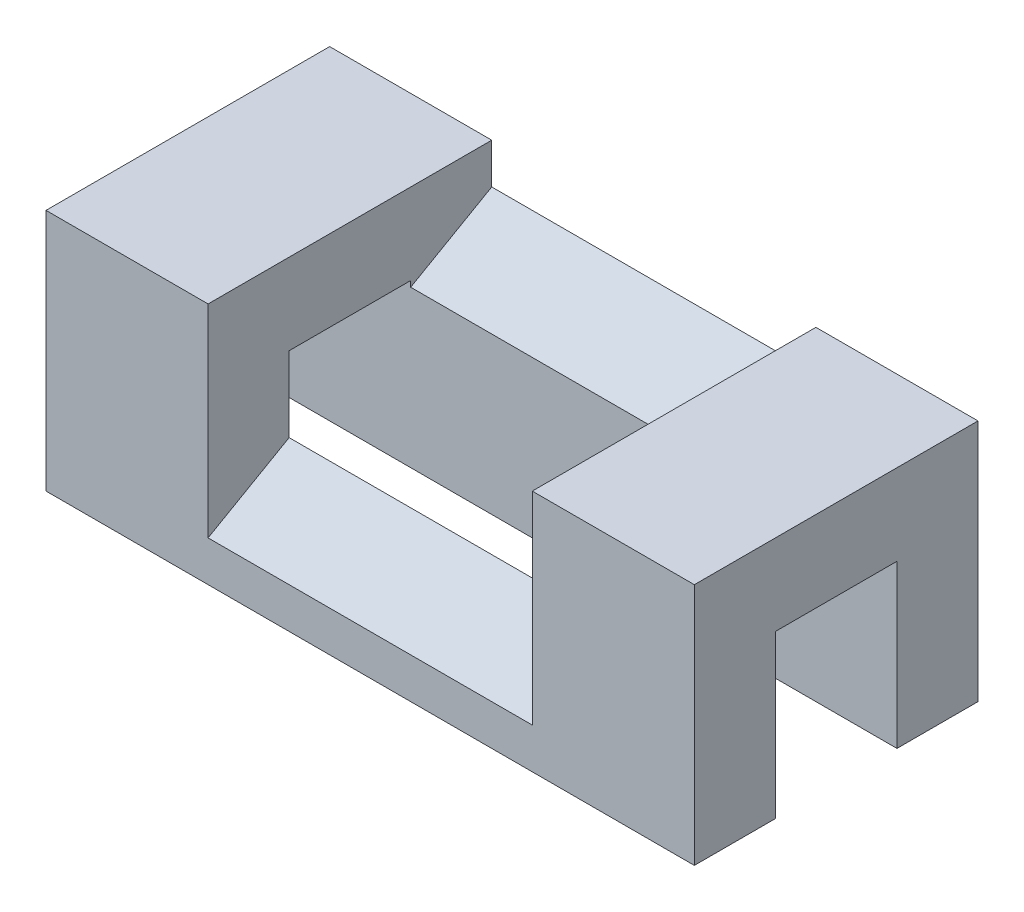
ISO-10303-21;
HEADER;
FILE_DESCRIPTION(('STEP AP214'),'2;1');
FILE_NAME('part.step','',(''),(''),'','','');
FILE_SCHEMA(('AUTOMOTIVE_DESIGN { 1 0 10303 214 1 1 1 1 }'));
ENDSEC;
DATA;
#1=APPLICATION_CONTEXT('core data for automotive mechanical design processes');
#2=APPLICATION_PROTOCOL_DEFINITION('international standard','automotive_design',2000,#1);
#3=PRODUCT_CONTEXT('',#1,'mechanical');
#4=PRODUCT('Part','Part','',(#3));
#5=PRODUCT_RELATED_PRODUCT_CATEGORY('part','',(#4));
#6=PRODUCT_DEFINITION_FORMATION('','',#4);
#7=PRODUCT_DEFINITION_CONTEXT('part definition',#1,'design');
#8=PRODUCT_DEFINITION('design','',#6,#7);
#9=PRODUCT_DEFINITION_SHAPE('','',#8);
#10=(LENGTH_UNIT() NAMED_UNIT(*) SI_UNIT(.MILLI.,.METRE.));
#11=(NAMED_UNIT(*) PLANE_ANGLE_UNIT() SI_UNIT($,.RADIAN.));
#12=(NAMED_UNIT(*) SI_UNIT($,.STERADIAN.) SOLID_ANGLE_UNIT());
#13=UNCERTAINTY_MEASURE_WITH_UNIT(LENGTH_MEASURE(1.E-05),#10,'distance_accuracy_value','');
#14=(GEOMETRIC_REPRESENTATION_CONTEXT(3) GLOBAL_UNCERTAINTY_ASSIGNED_CONTEXT((#13)) GLOBAL_UNIT_ASSIGNED_CONTEXT((#10,
#11,#12)) REPRESENTATION_CONTEXT('',''));
#15=CARTESIAN_POINT('',(0.,0.,0.));
#16=DIRECTION('',(0.,0.,1.));
#17=DIRECTION('',(1.,0.,0.));
#18=AXIS2_PLACEMENT_3D('',#15,#16,#17);
#19=CARTESIAN_POINT('',(-80.,0.,0.));
#20=DIRECTION('',(0.,0.,1.));
#21=DIRECTION('',(1.,0.,0.));
#22=AXIS2_PLACEMENT_3D('',#19,#20,#21);
#23=PLANE('',#22);
#24=DIRECTION('',(1.,0.,0.));
#25=VECTOR('',#24,1.);
#26=CARTESIAN_POINT('',(-80.,30.,0.));
#27=LINE('',#26,#25);
#28=CARTESIAN_POINT('',(-20.,30.,0.));
#29=VERTEX_POINT('',#28);
#30=CARTESIAN_POINT('',(0.,30.,0.));
#31=VERTEX_POINT('',#30);
#32=EDGE_CURVE('E174',#29,#31,#27,.T.);
#33=ORIENTED_EDGE('',*,*,#32,.F.);
#34=DIRECTION('',(0.,-1.,0.));
#35=VECTOR('',#34,1.);
#36=CARTESIAN_POINT('',(-20.,5.,0.));
#37=LINE('',#36,#35);
#38=CARTESIAN_POINT('',(-20.,5.,0.));
#39=VERTEX_POINT('',#38);
#40=EDGE_CURVE('E214',#29,#39,#37,.T.);
#41=ORIENTED_EDGE('',*,*,#40,.T.);
#42=DIRECTION('',(-1.,0.,0.));
#43=VECTOR('',#42,1.);
#44=CARTESIAN_POINT('',(-20.,5.,0.));
#45=LINE('',#44,#43);
#46=CARTESIAN_POINT('',(-60.,5.,0.));
#47=VERTEX_POINT('',#46);
#48=EDGE_CURVE('E166',#39,#47,#45,.T.);
#49=ORIENTED_EDGE('',*,*,#48,.T.);
#50=DIRECTION('',(0.,-1.,0.));
#51=VECTOR('',#50,1.);
#52=CARTESIAN_POINT('',(-60.,5.,0.));
#53=LINE('',#52,#51);
#54=CARTESIAN_POINT('',(-60.,30.,0.));
#55=VERTEX_POINT('',#54);
#56=EDGE_CURVE('E152',#55,#47,#53,.T.);
#57=ORIENTED_EDGE('',*,*,#56,.F.);
#58=CARTESIAN_POINT('',(-80.,30.,0.));
#59=VERTEX_POINT('',#58);
#60=EDGE_CURVE('E163',#59,#55,#27,.T.);
#61=ORIENTED_EDGE('',*,*,#60,.F.);
#62=DIRECTION('',(0.,-1.,0.));
#63=VECTOR('',#62,1.);
#64=CARTESIAN_POINT('',(-80.,0.,0.));
#65=LINE('',#64,#63);
#66=CARTESIAN_POINT('',(-80.,0.,0.));
#67=VERTEX_POINT('',#66);
#68=EDGE_CURVE('E197',#59,#67,#65,.T.);
#69=ORIENTED_EDGE('',*,*,#68,.T.);
#70=DIRECTION('',(1.,0.,0.));
#71=VECTOR('',#70,1.);
#72=CARTESIAN_POINT('',(-80.,0.,0.));
#73=LINE('',#72,#71);
#74=CARTESIAN_POINT('',(0.,0.,0.));
#75=VERTEX_POINT('',#74);
#76=EDGE_CURVE('E173',#67,#75,#73,.T.);
#77=ORIENTED_EDGE('',*,*,#76,.T.);
#78=DIRECTION('',(0.,-1.,0.));
#79=VECTOR('',#78,1.);
#80=CARTESIAN_POINT('',(0.,0.,0.));
#81=LINE('',#80,#79);
#82=EDGE_CURVE('E238',#31,#75,#81,.T.);
#83=ORIENTED_EDGE('',*,*,#82,.F.);
#84=EDGE_LOOP('',(#33,#41,#49,#57,#61,#69,#77,#83));
#85=FACE_BOUND('',#84,.T.);
#86=ADVANCED_FACE('F37',(#85),#23,.T.);
#87=CARTESIAN_POINT('',(-80.,30.,0.));
#88=DIRECTION('',(0.,1.,0.));
#89=DIRECTION('',(0.,0.,1.));
#90=AXIS2_PLACEMENT_3D('',#87,#88,#89);
#91=PLANE('',#90);
#92=DIRECTION('',(1.,0.,0.));
#93=VECTOR('',#92,1.);
#94=CARTESIAN_POINT('',(-80.,30.,-35.));
#95=LINE('',#94,#93);
#96=CARTESIAN_POINT('',(-20.,30.,-35.));
#97=VERTEX_POINT('',#96);
#98=CARTESIAN_POINT('',(0.,30.,-35.));
#99=VERTEX_POINT('',#98);
#100=EDGE_CURVE('E182',#97,#99,#95,.T.);
#101=ORIENTED_EDGE('',*,*,#100,.F.);
#102=DIRECTION('',(0.,0.,1.));
#103=VECTOR('',#102,1.);
#104=CARTESIAN_POINT('',(-20.,30.,0.));
#105=LINE('',#104,#103);
#106=EDGE_CURVE('E305',#97,#29,#105,.T.);
#107=ORIENTED_EDGE('',*,*,#106,.T.);
#108=ORIENTED_EDGE('',*,*,#32,.T.);
#109=DIRECTION('',(0.,0.,1.));
#110=VECTOR('',#109,1.);
#111=CARTESIAN_POINT('',(0.,30.,0.));
#112=LINE('',#111,#110);
#113=EDGE_CURVE('E272',#99,#31,#112,.T.);
#114=ORIENTED_EDGE('',*,*,#113,.F.);
#115=EDGE_LOOP('',(#101,#107,#108,#114));
#116=FACE_BOUND('',#115,.T.);
#117=ADVANCED_FACE('F304',(#116),#91,.T.);
#118=CARTESIAN_POINT('',(-80.,30.,-35.));
#119=DIRECTION('',(0.,0.,-1.));
#120=DIRECTION('',(0.,1.,0.));
#121=AXIS2_PLACEMENT_3D('',#118,#119,#120);
#122=PLANE('',#121);
#123=DIRECTION('',(-1.,0.,0.));
#124=VECTOR('',#123,1.);
#125=CARTESIAN_POINT('',(-20.,25.,-35.));
#126=LINE('',#125,#124);
#127=CARTESIAN_POINT('',(-20.,25.,-35.));
#128=VERTEX_POINT('',#127);
#129=CARTESIAN_POINT('',(-60.,25.,-35.));
#130=VERTEX_POINT('',#129);
#131=EDGE_CURVE('E52',#128,#130,#126,.T.);
#132=ORIENTED_EDGE('',*,*,#131,.F.);
#133=DIRECTION('',(0.,1.,0.));
#134=VECTOR('',#133,1.);
#135=CARTESIAN_POINT('',(-20.,30.,-35.));
#136=LINE('',#135,#134);
#137=EDGE_CURVE('E209',#128,#97,#136,.T.);
#138=ORIENTED_EDGE('',*,*,#137,.T.);
#139=ORIENTED_EDGE('',*,*,#100,.T.);
#140=DIRECTION('',(0.,1.,0.));
#141=VECTOR('',#140,1.);
#142=CARTESIAN_POINT('',(0.,30.,-35.));
#143=LINE('',#142,#141);
#144=CARTESIAN_POINT('',(0.,0.,-35.));
#145=VERTEX_POINT('',#144);
#146=EDGE_CURVE('E269',#145,#99,#143,.T.);
#147=ORIENTED_EDGE('',*,*,#146,.F.);
#148=DIRECTION('',(1.,0.,0.));
#149=VECTOR('',#148,1.);
#150=CARTESIAN_POINT('',(-80.,0.,-35.));
#151=LINE('',#150,#149);
#152=CARTESIAN_POINT('',(-80.,0.,-35.));
#153=VERTEX_POINT('',#152);
#154=EDGE_CURVE('E183',#153,#145,#151,.T.);
#155=ORIENTED_EDGE('',*,*,#154,.F.);
#156=DIRECTION('',(0.,1.,0.));
#157=VECTOR('',#156,1.);
#158=CARTESIAN_POINT('',(-80.,30.,-35.));
#159=LINE('',#158,#157);
#160=CARTESIAN_POINT('',(-80.,30.,-35.));
#161=VERTEX_POINT('',#160);
#162=EDGE_CURVE('E250',#153,#161,#159,.T.);
#163=ORIENTED_EDGE('',*,*,#162,.T.);
#164=CARTESIAN_POINT('',(-60.,30.,-35.));
#165=VERTEX_POINT('',#164);
#166=EDGE_CURVE('E178',#161,#165,#95,.T.);
#167=ORIENTED_EDGE('',*,*,#166,.T.);
#168=DIRECTION('',(0.,1.,0.));
#169=VECTOR('',#168,1.);
#170=CARTESIAN_POINT('',(-60.,30.,-35.));
#171=LINE('',#170,#169);
#172=EDGE_CURVE('E155',#130,#165,#171,.T.);
#173=ORIENTED_EDGE('',*,*,#172,.F.);
#174=EDGE_LOOP('',(#132,#138,#139,#147,#155,#163,#167,#173));
#175=FACE_BOUND('',#174,.T.);
#176=ADVANCED_FACE('F298',(#175),#122,.T.);
#177=CARTESIAN_POINT('',(-80.,20.,-25.));
#178=DIRECTION('',(0.,0.,1.));
#179=DIRECTION('',(0.,-1.,0.));
#180=AXIS2_PLACEMENT_3D('',#177,#178,#179);
#181=PLANE('',#180);
#182=DIRECTION('',(1.,0.,0.));
#183=VECTOR('',#182,1.);
#184=CARTESIAN_POINT('',(-80.,20.,-25.));
#185=LINE('',#184,#183);
#186=CARTESIAN_POINT('',(-20.,20.,-25.));
#187=VERTEX_POINT('',#186);
#188=CARTESIAN_POINT('',(0.,20.,-25.));
#189=VERTEX_POINT('',#188);
#190=EDGE_CURVE('E190',#187,#189,#185,.T.);
#191=ORIENTED_EDGE('',*,*,#190,.F.);
#192=DIRECTION('',(0.,-1.,0.));
#193=VECTOR('',#192,1.);
#194=CARTESIAN_POINT('',(-20.,20.,-25.));
#195=LINE('',#194,#193);
#196=CARTESIAN_POINT('',(-20.,19.2857142857143,-25.));
#197=VERTEX_POINT('',#196);
#198=EDGE_CURVE('E227',#187,#197,#195,.T.);
#199=ORIENTED_EDGE('',*,*,#198,.T.);
#200=DIRECTION('',(-1.,0.,0.));
#201=VECTOR('',#200,1.);
#202=CARTESIAN_POINT('',(-80.,19.2857142857143,-25.));
#203=LINE('',#202,#201);
#204=CARTESIAN_POINT('',(-60.,19.2857142857143,-25.));
#205=VERTEX_POINT('',#204);
#206=EDGE_CURVE('E230',#197,#205,#203,.T.);
#207=ORIENTED_EDGE('',*,*,#206,.T.);
#208=DIRECTION('',(0.,-1.,0.));
#209=VECTOR('',#208,1.);
#210=CARTESIAN_POINT('',(-60.,20.,-25.));
#211=LINE('',#210,#209);
#212=CARTESIAN_POINT('',(-60.,20.,-25.));
#213=VERTEX_POINT('',#212);
#214=EDGE_CURVE('E222',#213,#205,#211,.T.);
#215=ORIENTED_EDGE('',*,*,#214,.F.);
#216=CARTESIAN_POINT('',(-80.,20.,-25.));
#217=VERTEX_POINT('',#216);
#218=EDGE_CURVE('E187',#217,#213,#185,.T.);
#219=ORIENTED_EDGE('',*,*,#218,.F.);
#220=DIRECTION('',(0.,-1.,0.));
#221=VECTOR('',#220,1.);
#222=CARTESIAN_POINT('',(-80.,20.,-25.));
#223=LINE('',#222,#221);
#224=CARTESIAN_POINT('',(-80.,0.,-25.));
#225=VERTEX_POINT('',#224);
#226=EDGE_CURVE('E244',#217,#225,#223,.T.);
#227=ORIENTED_EDGE('',*,*,#226,.T.);
#228=DIRECTION('',(1.,0.,0.));
#229=VECTOR('',#228,1.);
#230=CARTESIAN_POINT('',(-80.,0.,-25.));
#231=LINE('',#230,#229);
#232=CARTESIAN_POINT('',(0.,0.,-25.));
#233=VERTEX_POINT('',#232);
#234=EDGE_CURVE('E185',#225,#233,#231,.T.);
#235=ORIENTED_EDGE('',*,*,#234,.T.);
#236=DIRECTION('',(0.,-1.,0.));
#237=VECTOR('',#236,1.);
#238=CARTESIAN_POINT('',(0.,20.,-25.));
#239=LINE('',#238,#237);
#240=EDGE_CURVE('E263',#189,#233,#239,.T.);
#241=ORIENTED_EDGE('',*,*,#240,.F.);
#242=EDGE_LOOP('',(#191,#199,#207,#215,#219,#227,#235,#241));
#243=FACE_BOUND('',#242,.T.);
#244=ADVANCED_FACE('F290',(#243),#181,.T.);
#245=CARTESIAN_POINT('',(-80.,20.,-10.));
#246=DIRECTION('',(0.,-1.,0.));
#247=DIRECTION('',(0.,0.,-1.));
#248=AXIS2_PLACEMENT_3D('',#245,#246,#247);
#249=PLANE('',#248);
#250=DIRECTION('',(1.,0.,0.));
#251=VECTOR('',#250,1.);
#252=CARTESIAN_POINT('',(-80.,20.,-10.));
#253=LINE('',#252,#251);
#254=CARTESIAN_POINT('',(-20.,20.,-10.));
#255=VERTEX_POINT('',#254);
#256=CARTESIAN_POINT('',(0.,20.,-10.));
#257=VERTEX_POINT('',#256);
#258=EDGE_CURVE('E194',#255,#257,#253,.T.);
#259=ORIENTED_EDGE('',*,*,#258,.F.);
#260=DIRECTION('',(0.,0.,-1.));
#261=VECTOR('',#260,1.);
#262=CARTESIAN_POINT('',(-20.,20.,-10.));
#263=LINE('',#262,#261);
#264=EDGE_CURVE('E224',#255,#187,#263,.T.);
#265=ORIENTED_EDGE('',*,*,#264,.T.);
#266=ORIENTED_EDGE('',*,*,#190,.T.);
#267=DIRECTION('',(0.,0.,-1.));
#268=VECTOR('',#267,1.);
#269=CARTESIAN_POINT('',(0.,20.,-10.));
#270=LINE('',#269,#268);
#271=EDGE_CURVE('E260',#257,#189,#270,.T.);
#272=ORIENTED_EDGE('',*,*,#271,.F.);
#273=EDGE_LOOP('',(#259,#265,#266,#272));
#274=FACE_BOUND('',#273,.T.);
#275=ADVANCED_FACE('F287',(#274),#249,.T.);
#276=CARTESIAN_POINT('',(-80.,0.,-10.));
#277=DIRECTION('',(0.,0.,-1.));
#278=DIRECTION('',(-1.,0.,0.));
#279=AXIS2_PLACEMENT_3D('',#276,#277,#278);
#280=PLANE('',#279);
#281=DIRECTION('',(1.,0.,0.));
#282=VECTOR('',#281,1.);
#283=CARTESIAN_POINT('',(-80.,10.7142857142857,-10.));
#284=LINE('',#283,#282);
#285=CARTESIAN_POINT('',(-60.,10.7142857142857,-10.));
#286=VERTEX_POINT('',#285);
#287=CARTESIAN_POINT('',(-20.,10.7142857142857,-10.));
#288=VERTEX_POINT('',#287);
#289=EDGE_CURVE('E45',#286,#288,#284,.T.);
#290=ORIENTED_EDGE('',*,*,#289,.T.);
#291=DIRECTION('',(0.,1.,0.));
#292=VECTOR('',#291,1.);
#293=CARTESIAN_POINT('',(-20.,0.,-10.));
#294=LINE('',#293,#292);
#295=EDGE_CURVE('E11',#288,#255,#294,.T.);
#296=ORIENTED_EDGE('',*,*,#295,.T.);
#297=ORIENTED_EDGE('',*,*,#258,.T.);
#298=DIRECTION('',(0.,1.,0.));
#299=VECTOR('',#298,1.);
#300=CARTESIAN_POINT('',(0.,0.,-10.));
#301=LINE('',#300,#299);
#302=CARTESIAN_POINT('',(0.,0.,-10.));
#303=VERTEX_POINT('',#302);
#304=EDGE_CURVE('E257',#303,#257,#301,.T.);
#305=ORIENTED_EDGE('',*,*,#304,.F.);
#306=DIRECTION('',(1.,0.,0.));
#307=VECTOR('',#306,1.);
#308=CARTESIAN_POINT('',(-80.,0.,-10.));
#309=LINE('',#308,#307);
#310=CARTESIAN_POINT('',(-80.,0.,-10.));
#311=VERTEX_POINT('',#310);
#312=EDGE_CURVE('E195',#311,#303,#309,.T.);
#313=ORIENTED_EDGE('',*,*,#312,.F.);
#314=DIRECTION('',(0.,1.,0.));
#315=VECTOR('',#314,1.);
#316=CARTESIAN_POINT('',(-80.,0.,-10.));
#317=LINE('',#316,#315);
#318=CARTESIAN_POINT('',(-80.,20.,-10.));
#319=VERTEX_POINT('',#318);
#320=EDGE_CURVE('E237',#311,#319,#317,.T.);
#321=ORIENTED_EDGE('',*,*,#320,.T.);
#322=CARTESIAN_POINT('',(-60.,20.,-10.));
#323=VERTEX_POINT('',#322);
#324=EDGE_CURVE('E191',#319,#323,#253,.T.);
#325=ORIENTED_EDGE('',*,*,#324,.T.);
#326=DIRECTION('',(0.,1.,0.));
#327=VECTOR('',#326,1.);
#328=CARTESIAN_POINT('',(-60.,0.,-10.));
#329=LINE('',#328,#327);
#330=EDGE_CURVE('E176',#286,#323,#329,.T.);
#331=ORIENTED_EDGE('',*,*,#330,.F.);
#332=EDGE_LOOP('',(#290,#296,#297,#305,#313,#321,#325,#331));
#333=FACE_BOUND('',#332,.T.);
#334=ADVANCED_FACE('F201',(#333),#280,.T.);
#335=CARTESIAN_POINT('',(-80.,0.,-10.));
#336=DIRECTION('',(0.,-1.,0.));
#337=DIRECTION('',(0.,0.,-1.));
#338=AXIS2_PLACEMENT_3D('',#335,#336,#337);
#339=PLANE('',#338);
#340=DIRECTION('',(0.,0.,-1.));
#341=VECTOR('',#340,1.);
#342=CARTESIAN_POINT('',(0.,0.,-10.));
#343=LINE('',#342,#341);
#344=EDGE_CURVE('E233',#75,#303,#343,.T.);
#345=ORIENTED_EDGE('',*,*,#344,.F.);
#346=ORIENTED_EDGE('',*,*,#76,.F.);
#347=DIRECTION('',(0.,0.,-1.));
#348=VECTOR('',#347,1.);
#349=CARTESIAN_POINT('',(-80.,0.,-10.));
#350=LINE('',#349,#348);
#351=EDGE_CURVE('E234',#67,#311,#350,.T.);
#352=ORIENTED_EDGE('',*,*,#351,.T.);
#353=ORIENTED_EDGE('',*,*,#312,.T.);
#354=EDGE_LOOP('',(#345,#346,#352,#353));
#355=FACE_BOUND('',#354,.T.);
#356=ADVANCED_FACE('F39',(#355),#339,.T.);
#357=DIRECTION('',(0.,0.,1.));
#358=VECTOR('',#357,1.);
#359=CARTESIAN_POINT('',(-60.,30.,0.));
#360=LINE('',#359,#358);
#361=EDGE_CURVE('E149',#165,#55,#360,.T.);
#362=ORIENTED_EDGE('',*,*,#361,.F.);
#363=ORIENTED_EDGE('',*,*,#166,.F.);
#364=DIRECTION('',(0.,0.,1.));
#365=VECTOR('',#364,1.);
#366=CARTESIAN_POINT('',(-80.,30.,0.));
#367=LINE('',#366,#365);
#368=EDGE_CURVE('E171',#161,#59,#367,.T.);
#369=ORIENTED_EDGE('',*,*,#368,.T.);
#370=ORIENTED_EDGE('',*,*,#60,.T.);
#371=EDGE_LOOP('',(#362,#363,#369,#370));
#372=FACE_BOUND('',#371,.T.);
#373=ADVANCED_FACE('F169',(#372),#91,.T.);
#374=CARTESIAN_POINT('',(-80.,0.,-35.));
#375=DIRECTION('',(0.,-1.,0.));
#376=DIRECTION('',(0.,0.,-1.));
#377=AXIS2_PLACEMENT_3D('',#374,#375,#376);
#378=PLANE('',#377);
#379=DIRECTION('',(0.,0.,-1.));
#380=VECTOR('',#379,1.);
#381=CARTESIAN_POINT('',(0.,0.,-35.));
#382=LINE('',#381,#380);
#383=EDGE_CURVE('E266',#233,#145,#382,.T.);
#384=ORIENTED_EDGE('',*,*,#383,.F.);
#385=ORIENTED_EDGE('',*,*,#234,.F.);
#386=DIRECTION('',(0.,0.,-1.));
#387=VECTOR('',#386,1.);
#388=CARTESIAN_POINT('',(-80.,0.,-35.));
#389=LINE('',#388,#387);
#390=EDGE_CURVE('E247',#225,#153,#389,.T.);
#391=ORIENTED_EDGE('',*,*,#390,.T.);
#392=ORIENTED_EDGE('',*,*,#154,.T.);
#393=EDGE_LOOP('',(#384,#385,#391,#392));
#394=FACE_BOUND('',#393,.T.);
#395=ADVANCED_FACE('F295',(#394),#378,.T.);
#396=DIRECTION('',(0.,0.,-1.));
#397=VECTOR('',#396,1.);
#398=CARTESIAN_POINT('',(-60.,20.,-10.));
#399=LINE('',#398,#397);
#400=EDGE_CURVE('E220',#323,#213,#399,.T.);
#401=ORIENTED_EDGE('',*,*,#400,.F.);
#402=ORIENTED_EDGE('',*,*,#324,.F.);
#403=DIRECTION('',(0.,0.,-1.));
#404=VECTOR('',#403,1.);
#405=CARTESIAN_POINT('',(-80.,20.,-10.));
#406=LINE('',#405,#404);
#407=EDGE_CURVE('E241',#319,#217,#406,.T.);
#408=ORIENTED_EDGE('',*,*,#407,.T.);
#409=ORIENTED_EDGE('',*,*,#218,.T.);
#410=EDGE_LOOP('',(#401,#402,#408,#409));
#411=FACE_BOUND('',#410,.T.);
#412=ADVANCED_FACE('F314',(#411),#249,.T.);
#413=CARTESIAN_POINT('',(-80.,0.,0.));
#414=DIRECTION('',(-1.,0.,0.));
#415=DIRECTION('',(0.,0.,1.));
#416=AXIS2_PLACEMENT_3D('',#413,#414,#415);
#417=PLANE('',#416);
#418=ORIENTED_EDGE('',*,*,#351,.F.);
#419=ORIENTED_EDGE('',*,*,#68,.F.);
#420=ORIENTED_EDGE('',*,*,#368,.F.);
#421=ORIENTED_EDGE('',*,*,#162,.F.);
#422=ORIENTED_EDGE('',*,*,#390,.F.);
#423=ORIENTED_EDGE('',*,*,#226,.F.);
#424=ORIENTED_EDGE('',*,*,#407,.F.);
#425=ORIENTED_EDGE('',*,*,#320,.F.);
#426=EDGE_LOOP('',(#418,#419,#420,#421,#422,#423,#424,#425));
#427=FACE_BOUND('',#426,.T.);
#428=ADVANCED_FACE('F310',(#427),#417,.T.);
#429=CARTESIAN_POINT('',(0.,0.,0.));
#430=DIRECTION('',(-1.,0.,0.));
#431=DIRECTION('',(0.,0.,1.));
#432=AXIS2_PLACEMENT_3D('',#429,#430,#431);
#433=PLANE('',#432);
#434=ORIENTED_EDGE('',*,*,#344,.T.);
#435=ORIENTED_EDGE('',*,*,#304,.T.);
#436=ORIENTED_EDGE('',*,*,#271,.T.);
#437=ORIENTED_EDGE('',*,*,#240,.T.);
#438=ORIENTED_EDGE('',*,*,#383,.T.);
#439=ORIENTED_EDGE('',*,*,#146,.T.);
#440=ORIENTED_EDGE('',*,*,#113,.T.);
#441=ORIENTED_EDGE('',*,*,#82,.T.);
#442=EDGE_LOOP('',(#434,#435,#436,#437,#438,#439,#440,#441));
#443=FACE_BOUND('',#442,.T.);
#444=ADVANCED_FACE('F277',(#443),#433,.F.);
#445=CARTESIAN_POINT('',(-20.,25.,-35.));
#446=DIRECTION('',(0.,0.868243142124459,0.496138938356834));
#447=DIRECTION('',(0.,-0.496138938356834,0.868243142124459));
#448=AXIS2_PLACEMENT_3D('',#445,#446,#447);
#449=PLANE('',#448);
#450=DIRECTION('',(0.,0.496138938356834,-0.868243142124459));
#451=VECTOR('',#450,1.);
#452=CARTESIAN_POINT('',(-20.,25.,-35.));
#453=LINE('',#452,#451);
#454=EDGE_CURVE('E210',#197,#128,#453,.T.);
#455=ORIENTED_EDGE('',*,*,#454,.T.);
#456=ORIENTED_EDGE('',*,*,#131,.T.);
#457=DIRECTION('',(0.,0.496138938356834,-0.868243142124459));
#458=VECTOR('',#457,1.);
#459=CARTESIAN_POINT('',(-60.,25.,-35.));
#460=LINE('',#459,#458);
#461=EDGE_CURVE('E167',#205,#130,#460,.T.);
#462=ORIENTED_EDGE('',*,*,#461,.F.);
#463=ORIENTED_EDGE('',*,*,#206,.F.);
#464=EDGE_LOOP('',(#455,#456,#462,#463));
#465=FACE_BOUND('',#464,.T.);
#466=ADVANCED_FACE('F316',(#465),#449,.T.);
#467=EDGE_CURVE('E60',#47,#286,#460,.T.);
#468=ORIENTED_EDGE('',*,*,#467,.F.);
#469=ORIENTED_EDGE('',*,*,#48,.F.);
#470=EDGE_CURVE('E207',#39,#288,#453,.T.);
#471=ORIENTED_EDGE('',*,*,#470,.T.);
#472=ORIENTED_EDGE('',*,*,#289,.F.);
#473=EDGE_LOOP('',(#468,#469,#471,#472));
#474=FACE_BOUND('',#473,.T.);
#475=ADVANCED_FACE('F205',(#474),#449,.T.);
#476=CARTESIAN_POINT('',(-20.,0.,0.));
#477=DIRECTION('',(-1.,0.,0.));
#478=DIRECTION('',(0.,0.,1.));
#479=AXIS2_PLACEMENT_3D('',#476,#477,#478);
#480=PLANE('',#479);
#481=ORIENTED_EDGE('',*,*,#264,.F.);
#482=ORIENTED_EDGE('',*,*,#295,.F.);
#483=ORIENTED_EDGE('',*,*,#470,.F.);
#484=ORIENTED_EDGE('',*,*,#40,.F.);
#485=ORIENTED_EDGE('',*,*,#106,.F.);
#486=ORIENTED_EDGE('',*,*,#137,.F.);
#487=ORIENTED_EDGE('',*,*,#454,.F.);
#488=ORIENTED_EDGE('',*,*,#198,.F.);
#489=EDGE_LOOP('',(#481,#482,#483,#484,#485,#486,#487,#488));
#490=FACE_BOUND('',#489,.T.);
#491=ADVANCED_FACE('F317',(#490),#480,.T.);
#492=CARTESIAN_POINT('',(-60.,0.,0.));
#493=DIRECTION('',(-1.,0.,0.));
#494=DIRECTION('',(0.,0.,1.));
#495=AXIS2_PLACEMENT_3D('',#492,#493,#494);
#496=PLANE('',#495);
#497=ORIENTED_EDGE('',*,*,#214,.T.);
#498=ORIENTED_EDGE('',*,*,#461,.T.);
#499=ORIENTED_EDGE('',*,*,#172,.T.);
#500=ORIENTED_EDGE('',*,*,#361,.T.);
#501=ORIENTED_EDGE('',*,*,#56,.T.);
#502=ORIENTED_EDGE('',*,*,#467,.T.);
#503=ORIENTED_EDGE('',*,*,#330,.T.);
#504=ORIENTED_EDGE('',*,*,#400,.T.);
#505=EDGE_LOOP('',(#497,#498,#499,#500,#501,#502,#503,#504));
#506=FACE_BOUND('',#505,.T.);
#507=ADVANCED_FACE('F151',(#506),#496,.F.);
#508=CLOSED_SHELL('',(#86,#117,#176,#244,#275,#334,#356,#373,#395,#412,#428,#444,#466,#475,#491,#507));
#509=MANIFOLD_SOLID_BREP('B2',#508);
#510=ADVANCED_BREP_SHAPE_REPRESENTATION('',(#18,#509),#14);
#511=SHAPE_DEFINITION_REPRESENTATION(#9,#510);
ENDSEC;
END-ISO-10303-21;
